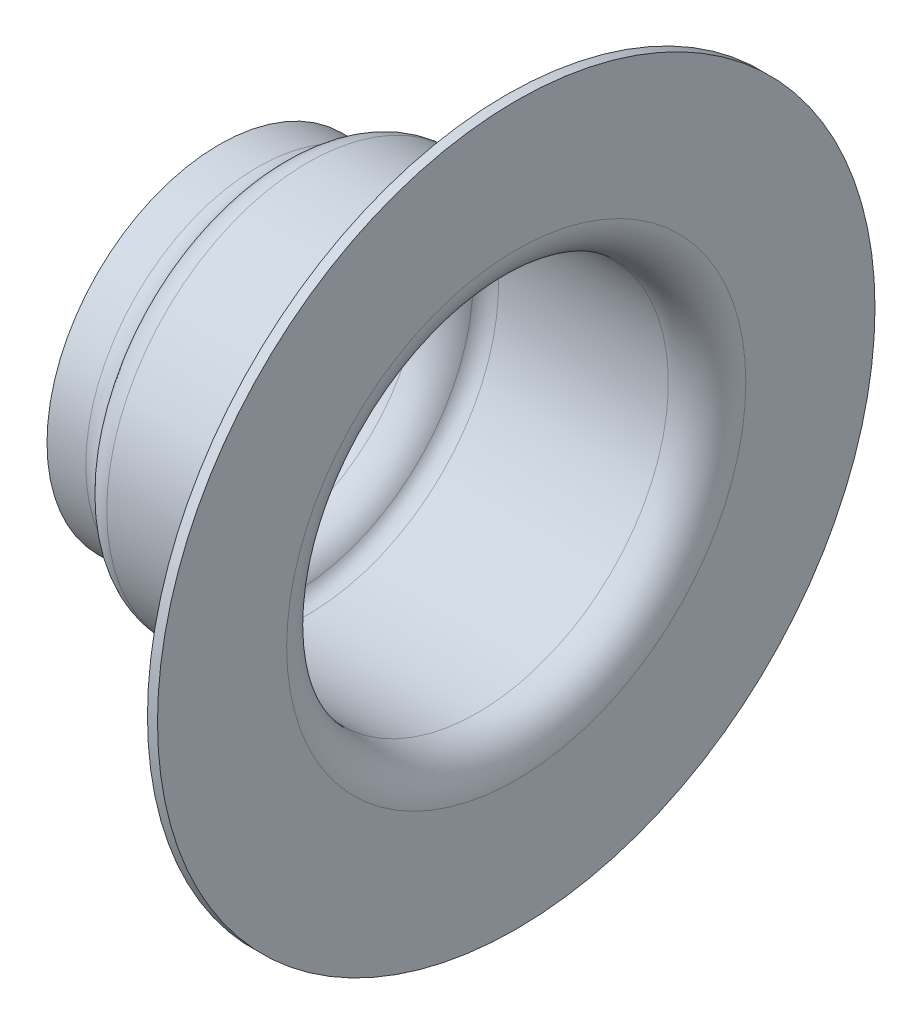
ISO-10303-21;
HEADER;
FILE_DESCRIPTION(('STEP AP214'),'2;1');
FILE_NAME('part.step','',(''),(''),'','','');
FILE_SCHEMA(('AUTOMOTIVE_DESIGN { 1 0 10303 214 1 1 1 1 }'));
ENDSEC;
DATA;
#1=APPLICATION_CONTEXT('core data for automotive mechanical design processes');
#2=APPLICATION_PROTOCOL_DEFINITION('international standard','automotive_design',2000,#1);
#3=PRODUCT_CONTEXT('',#1,'mechanical');
#4=PRODUCT('Part','Part','',(#3));
#5=PRODUCT_RELATED_PRODUCT_CATEGORY('part','',(#4));
#6=PRODUCT_DEFINITION_FORMATION('','',#4);
#7=PRODUCT_DEFINITION_CONTEXT('part definition',#1,'design');
#8=PRODUCT_DEFINITION('design','',#6,#7);
#9=PRODUCT_DEFINITION_SHAPE('','',#8);
#10=(LENGTH_UNIT() NAMED_UNIT(*) SI_UNIT(.MILLI.,.METRE.));
#11=(NAMED_UNIT(*) PLANE_ANGLE_UNIT() SI_UNIT($,.RADIAN.));
#12=(NAMED_UNIT(*) SI_UNIT($,.STERADIAN.) SOLID_ANGLE_UNIT());
#13=UNCERTAINTY_MEASURE_WITH_UNIT(LENGTH_MEASURE(1.E-05),#10,'distance_accuracy_value','');
#14=(GEOMETRIC_REPRESENTATION_CONTEXT(3) GLOBAL_UNCERTAINTY_ASSIGNED_CONTEXT((#13)) GLOBAL_UNIT_ASSIGNED_CONTEXT((#10,
#11,#12)) REPRESENTATION_CONTEXT('',''));
#15=CARTESIAN_POINT('',(0.,0.,0.));
#16=DIRECTION('',(0.,0.,1.));
#17=DIRECTION('',(1.,0.,0.));
#18=AXIS2_PLACEMENT_3D('',#15,#16,#17);
#19=CARTESIAN_POINT('',(284.436841982676,234.763666776708,16.9539636456932));
#20=DIRECTION('',(1.,0.,0.));
#21=DIRECTION('',(0.,0.,1.));
#22=AXIS2_PLACEMENT_3D('',#19,#20,#21);
#23=CYLINDRICAL_SURFACE('',#22,25.);
#24=CARTESIAN_POINT('',(285.136841982676,234.763666776708,16.9539636456932));
#25=DIRECTION('',(1.,0.,0.));
#26=DIRECTION('',(0.,0.,-1.));
#27=AXIS2_PLACEMENT_3D('',#24,#25,#26);
#28=CIRCLE('',#27,25.);
#29=CARTESIAN_POINT('',(285.136841982676,234.763666776708,-8.0460363543068));
#30=VERTEX_POINT('',#29);
#31=EDGE_CURVE('E34',#30,#30,#28,.T.);
#32=ORIENTED_EDGE('',*,*,#31,.F.);
#33=EDGE_LOOP('',(#32));
#34=FACE_BOUND('',#33,.T.);
#35=CARTESIAN_POINT('',(284.436841982676,234.763666776708,16.9539636456932));
#36=DIRECTION('',(1.,0.,0.));
#37=DIRECTION('',(0.,0.,-1.));
#38=AXIS2_PLACEMENT_3D('',#35,#36,#37);
#39=CIRCLE('',#38,25.);
#40=CARTESIAN_POINT('',(284.436841982676,234.763666776708,-8.0460363543068));
#41=VERTEX_POINT('',#40);
#42=EDGE_CURVE('E11',#41,#41,#39,.T.);
#43=ORIENTED_EDGE('',*,*,#42,.T.);
#44=EDGE_LOOP('',(#43));
#45=FACE_BOUND('',#44,.T.);
#46=ADVANCED_FACE('F17',(#34,#45),#23,.T.);
#47=CARTESIAN_POINT('',(264.436841982676,234.763666776708,16.9539636456932));
#48=DIRECTION('',(-1.,0.,0.));
#49=DIRECTION('',(0.,0.,-1.));
#50=AXIS2_PLACEMENT_3D('',#47,#48,#49);
#51=PLANE('',#50);
#52=CARTESIAN_POINT('',(264.436841982676,234.763666776708,16.9539636456932));
#53=DIRECTION('',(1.,0.,0.));
#54=DIRECTION('',(0.,0.,1.));
#55=AXIS2_PLACEMENT_3D('',#52,#53,#54);
#56=CIRCLE('',#55,11.3);
#57=CARTESIAN_POINT('',(264.436841982676,234.763666776708,28.2539636456932));
#58=VERTEX_POINT('',#57);
#59=EDGE_CURVE('E27',#58,#58,#56,.T.);
#60=ORIENTED_EDGE('',*,*,#59,.T.);
#61=EDGE_LOOP('',(#60));
#62=FACE_BOUND('',#61,.T.);
#63=CARTESIAN_POINT('',(264.436841982676,234.763666776708,16.9539636456932));
#64=DIRECTION('',(1.,0.,0.));
#65=DIRECTION('',(0.,0.,-1.));
#66=AXIS2_PLACEMENT_3D('',#63,#64,#65);
#67=CIRCLE('',#66,12.);
#68=CARTESIAN_POINT('',(264.436841982676,234.763666776708,4.9539636456932));
#69=VERTEX_POINT('',#68);
#70=EDGE_CURVE('E77',#69,#69,#67,.T.);
#71=ORIENTED_EDGE('',*,*,#70,.F.);
#72=EDGE_LOOP('',(#71));
#73=FACE_BOUND('',#72,.T.);
#74=ADVANCED_FACE('F129',(#62,#73),#51,.T.);
#75=CARTESIAN_POINT('',(285.136841982676,234.763666776708,16.9539636456932));
#76=DIRECTION('',(-1.,0.,0.));
#77=DIRECTION('',(0.,0.,-1.));
#78=AXIS2_PLACEMENT_3D('',#75,#76,#77);
#79=CYLINDRICAL_SURFACE('',#78,13.3);
#80=CARTESIAN_POINT('',(270.600943597814,234.763666776708,16.9539636456932));
#81=DIRECTION('',(1.,0.,0.));
#82=DIRECTION('',(0.,0.,1.));
#83=AXIS2_PLACEMENT_3D('',#80,#81,#82);
#84=CIRCLE('',#83,13.3);
#85=CARTESIAN_POINT('',(270.600943597814,234.763666776708,30.2539636456932));
#86=VERTEX_POINT('',#85);
#87=EDGE_CURVE('E87',#86,#86,#84,.T.);
#88=ORIENTED_EDGE('',*,*,#87,.F.);
#89=EDGE_LOOP('',(#88));
#90=FACE_BOUND('',#89,.T.);
#91=CARTESIAN_POINT('',(282.436841982676,234.763666776708,16.9539636456932));
#92=DIRECTION('',(-1.,0.,0.));
#93=DIRECTION('',(0.,0.,1.));
#94=AXIS2_PLACEMENT_3D('',#91,#92,#93);
#95=CIRCLE('',#94,13.3);
#96=CARTESIAN_POINT('',(282.436841982676,234.763666776708,30.2539636456932));
#97=VERTEX_POINT('',#96);
#98=EDGE_CURVE('E91',#97,#97,#95,.T.);
#99=ORIENTED_EDGE('',*,*,#98,.F.);
#100=EDGE_LOOP('',(#99));
#101=FACE_BOUND('',#100,.T.);
#102=ADVANCED_FACE('F134',(#90,#101),#79,.F.);
#103=CARTESIAN_POINT('',(270.600943597814,234.763666776708,16.9539636456932));
#104=DIRECTION('',(-1.,0.,0.));
#105=DIRECTION('',(0.,0.,-1.));
#106=AXIS2_PLACEMENT_3D('',#103,#104,#105);
#107=TOROIDAL_SURFACE('',#106,12.,1.3);
#108=CARTESIAN_POINT('',(269.475110572894,234.763666776708,16.9539636456932));
#109=DIRECTION('',(-1.,0.,0.));
#110=DIRECTION('',(0.,0.,1.));
#111=AXIS2_PLACEMENT_3D('',#108,#109,#110);
#112=CIRCLE('',#111,12.65);
#113=CARTESIAN_POINT('',(269.475110572894,234.763666776708,29.6039636456932));
#114=VERTEX_POINT('',#113);
#115=EDGE_CURVE('E90',#114,#114,#112,.T.);
#116=ORIENTED_EDGE('',*,*,#115,.T.);
#117=EDGE_LOOP('',(#116));
#118=FACE_BOUND('',#117,.T.);
#119=ORIENTED_EDGE('',*,*,#87,.T.);
#120=EDGE_LOOP('',(#119));
#121=FACE_BOUND('',#120,.T.);
#122=ADVANCED_FACE('F141',(#118,#121),#107,.F.);
#123=CARTESIAN_POINT('',(282.436841982676,234.763666776708,16.9539636456932));
#124=DIRECTION('',(-1.,0.,0.));
#125=DIRECTION('',(0.,0.,-1.));
#126=AXIS2_PLACEMENT_3D('',#123,#124,#125);
#127=TOROIDAL_SURFACE('',#126,16.,2.7);
#128=ORIENTED_EDGE('',*,*,#98,.T.);
#129=EDGE_LOOP('',(#128));
#130=FACE_BOUND('',#129,.T.);
#131=CARTESIAN_POINT('',(285.136841982676,234.763666776708,16.9539636456932));
#132=DIRECTION('',(1.,0.,0.));
#133=DIRECTION('',(0.,0.,1.));
#134=AXIS2_PLACEMENT_3D('',#131,#132,#133);
#135=CIRCLE('',#134,16.);
#136=CARTESIAN_POINT('',(285.136841982676,234.763666776708,32.9539636456932));
#137=VERTEX_POINT('',#136);
#138=EDGE_CURVE('E94',#137,#137,#135,.T.);
#139=ORIENTED_EDGE('',*,*,#138,.T.);
#140=EDGE_LOOP('',(#139));
#141=FACE_BOUND('',#140,.T.);
#142=ADVANCED_FACE('F145',(#130,#141),#127,.T.);
#143=CARTESIAN_POINT('',(285.136841982676,234.763666776708,16.9539636456932));
#144=DIRECTION('',(-1.,0.,0.));
#145=DIRECTION('',(0.,0.,-1.));
#146=AXIS2_PLACEMENT_3D('',#143,#144,#145);
#147=CYLINDRICAL_SURFACE('',#146,11.3);
#148=CARTESIAN_POINT('',(267.136841982676,234.763666776708,16.9539636456932));
#149=DIRECTION('',(-1.,0.,0.));
#150=DIRECTION('',(0.,0.,1.));
#151=AXIS2_PLACEMENT_3D('',#148,#149,#150);
#152=CIRCLE('',#151,11.3);
#153=CARTESIAN_POINT('',(267.136841982676,234.763666776708,28.2539636456932));
#154=VERTEX_POINT('',#153);
#155=EDGE_CURVE('E99',#154,#154,#152,.T.);
#156=ORIENTED_EDGE('',*,*,#155,.F.);
#157=EDGE_LOOP('',(#156));
#158=FACE_BOUND('',#157,.T.);
#159=ORIENTED_EDGE('',*,*,#59,.F.);
#160=EDGE_LOOP('',(#159));
#161=FACE_BOUND('',#160,.T.);
#162=ADVANCED_FACE('F149',(#158,#161),#147,.F.);
#163=CARTESIAN_POINT('',(285.136841982676,234.763666776708,16.9539636456932));
#164=DIRECTION('',(-1.,0.,0.));
#165=DIRECTION('',(0.,0.,-1.));
#166=AXIS2_PLACEMENT_3D('',#163,#164,#165);
#167=PLANE('',#166);
#168=ORIENTED_EDGE('',*,*,#138,.F.);
#169=EDGE_LOOP('',(#168));
#170=FACE_BOUND('',#169,.T.);
#171=ORIENTED_EDGE('',*,*,#31,.T.);
#172=EDGE_LOOP('',(#171));
#173=FACE_BOUND('',#172,.T.);
#174=ADVANCED_FACE('F153',(#170,#173),#167,.F.);
#175=CARTESIAN_POINT('',(267.136841982676,234.763666776708,16.9539636456932));
#176=DIRECTION('',(-1.,0.,0.));
#177=DIRECTION('',(0.,0.,-1.));
#178=AXIS2_PLACEMENT_3D('',#175,#176,#177);
#179=TOROIDAL_SURFACE('',#178,14.,2.7);
#180=ORIENTED_EDGE('',*,*,#115,.F.);
#181=EDGE_LOOP('',(#180));
#182=FACE_BOUND('',#181,.T.);
#183=ORIENTED_EDGE('',*,*,#155,.T.);
#184=EDGE_LOOP('',(#183));
#185=FACE_BOUND('',#184,.T.);
#186=ADVANCED_FACE('F116',(#182,#185),#179,.T.);
#187=CARTESIAN_POINT('',(285.136841982676,234.763666776708,16.9539636456932));
#188=DIRECTION('',(-1.,0.,0.));
#189=DIRECTION('',(0.,0.,-1.));
#190=AXIS2_PLACEMENT_3D('',#187,#188,#189);
#191=CYLINDRICAL_SURFACE('',#190,14.);
#192=CARTESIAN_POINT('',(270.600943597814,234.763666776708,16.9539636456932));
#193=DIRECTION('',(1.,0.,0.));
#194=DIRECTION('',(0.,0.,1.));
#195=AXIS2_PLACEMENT_3D('',#192,#193,#194);
#196=CIRCLE('',#195,14.);
#197=CARTESIAN_POINT('',(270.600943597814,234.763666776708,30.9539636456932));
#198=VERTEX_POINT('',#197);
#199=EDGE_CURVE('E79',#198,#198,#196,.T.);
#200=ORIENTED_EDGE('',*,*,#199,.T.);
#201=EDGE_LOOP('',(#200));
#202=FACE_BOUND('',#201,.T.);
#203=CARTESIAN_POINT('',(282.436841982676,234.763666776708,16.9539636456932));
#204=DIRECTION('',(-1.,0.,0.));
#205=DIRECTION('',(0.,0.,1.));
#206=AXIS2_PLACEMENT_3D('',#203,#204,#205);
#207=CIRCLE('',#206,14.);
#208=CARTESIAN_POINT('',(282.436841982676,234.763666776708,30.9539636456932));
#209=VERTEX_POINT('',#208);
#210=EDGE_CURVE('E76',#209,#209,#207,.T.);
#211=ORIENTED_EDGE('',*,*,#210,.T.);
#212=EDGE_LOOP('',(#211));
#213=FACE_BOUND('',#212,.T.);
#214=ADVANCED_FACE('F111',(#202,#213),#191,.T.);
#215=CARTESIAN_POINT('',(270.600943597814,234.763666776708,16.9539636456932));
#216=DIRECTION('',(-1.,0.,0.));
#217=DIRECTION('',(0.,0.,-1.));
#218=AXIS2_PLACEMENT_3D('',#215,#216,#217);
#219=TOROIDAL_SURFACE('',#218,12.,2.);
#220=CARTESIAN_POINT('',(268.868892790245,234.763666776708,16.9539636456932));
#221=DIRECTION('',(-1.,0.,0.));
#222=DIRECTION('',(0.,0.,1.));
#223=AXIS2_PLACEMENT_3D('',#220,#221,#222);
#224=CIRCLE('',#223,13.);
#225=CARTESIAN_POINT('',(268.868892790245,234.763666776708,29.9539636456932));
#226=VERTEX_POINT('',#225);
#227=EDGE_CURVE('E84',#226,#226,#224,.T.);
#228=ORIENTED_EDGE('',*,*,#227,.F.);
#229=EDGE_LOOP('',(#228));
#230=FACE_BOUND('',#229,.T.);
#231=ORIENTED_EDGE('',*,*,#199,.F.);
#232=EDGE_LOOP('',(#231));
#233=FACE_BOUND('',#232,.T.);
#234=ADVANCED_FACE('F107',(#230,#233),#219,.T.);
#235=CARTESIAN_POINT('',(282.436841982676,234.763666776708,16.9539636456932));
#236=DIRECTION('',(-1.,0.,0.));
#237=DIRECTION('',(0.,0.,-1.));
#238=AXIS2_PLACEMENT_3D('',#235,#236,#237);
#239=TOROIDAL_SURFACE('',#238,16.,2.);
#240=ORIENTED_EDGE('',*,*,#210,.F.);
#241=EDGE_LOOP('',(#240));
#242=FACE_BOUND('',#241,.T.);
#243=CARTESIAN_POINT('',(284.436841982676,234.763666776708,16.9539636456932));
#244=DIRECTION('',(1.,0.,0.));
#245=DIRECTION('',(0.,0.,1.));
#246=AXIS2_PLACEMENT_3D('',#243,#244,#245);
#247=CIRCLE('',#246,16.);
#248=CARTESIAN_POINT('',(284.436841982676,234.763666776708,32.9539636456932));
#249=VERTEX_POINT('',#248);
#250=EDGE_CURVE('E71',#249,#249,#247,.T.);
#251=ORIENTED_EDGE('',*,*,#250,.F.);
#252=EDGE_LOOP('',(#251));
#253=FACE_BOUND('',#252,.T.);
#254=ADVANCED_FACE('F110',(#242,#253),#239,.F.);
#255=CARTESIAN_POINT('',(285.136841982676,234.763666776708,16.9539636456932));
#256=DIRECTION('',(-1.,0.,0.));
#257=DIRECTION('',(0.,0.,-1.));
#258=AXIS2_PLACEMENT_3D('',#255,#256,#257);
#259=CYLINDRICAL_SURFACE('',#258,12.);
#260=CARTESIAN_POINT('',(267.136841982676,234.763666776708,16.9539636456932));
#261=DIRECTION('',(-1.,0.,0.));
#262=DIRECTION('',(0.,0.,1.));
#263=AXIS2_PLACEMENT_3D('',#260,#261,#262);
#264=CIRCLE('',#263,12.);
#265=CARTESIAN_POINT('',(267.136841982676,234.763666776708,28.9539636456932));
#266=VERTEX_POINT('',#265);
#267=EDGE_CURVE('E21',#266,#266,#264,.T.);
#268=ORIENTED_EDGE('',*,*,#267,.T.);
#269=EDGE_LOOP('',(#268));
#270=FACE_BOUND('',#269,.T.);
#271=ORIENTED_EDGE('',*,*,#70,.T.);
#272=EDGE_LOOP('',(#271));
#273=FACE_BOUND('',#272,.T.);
#274=ADVANCED_FACE('F120',(#270,#273),#259,.T.);
#275=CARTESIAN_POINT('',(284.436841982676,234.763666776708,16.9539636456932));
#276=DIRECTION('',(-1.,0.,0.));
#277=DIRECTION('',(0.,0.,-1.));
#278=AXIS2_PLACEMENT_3D('',#275,#276,#277);
#279=PLANE('',#278);
#280=ORIENTED_EDGE('',*,*,#250,.T.);
#281=EDGE_LOOP('',(#280));
#282=FACE_BOUND('',#281,.T.);
#283=ORIENTED_EDGE('',*,*,#42,.F.);
#284=EDGE_LOOP('',(#283));
#285=FACE_BOUND('',#284,.T.);
#286=ADVANCED_FACE('F126',(#282,#285),#279,.T.);
#287=CARTESIAN_POINT('',(267.136841982676,234.763666776708,16.9539636456932));
#288=DIRECTION('',(-1.,0.,0.));
#289=DIRECTION('',(0.,0.,-1.));
#290=AXIS2_PLACEMENT_3D('',#287,#288,#289);
#291=TOROIDAL_SURFACE('',#290,14.,2.);
#292=ORIENTED_EDGE('',*,*,#227,.T.);
#293=EDGE_LOOP('',(#292));
#294=FACE_BOUND('',#293,.T.);
#295=ORIENTED_EDGE('',*,*,#267,.F.);
#296=EDGE_LOOP('',(#295));
#297=FACE_BOUND('',#296,.T.);
#298=ADVANCED_FACE('F19',(#294,#297),#291,.F.);
#299=CLOSED_SHELL('',(#46,#74,#102,#122,#142,#162,#174,#186,#214,#234,#254,#274,#286,#298));
#300=MANIFOLD_SOLID_BREP('B1',#299);
#301=ADVANCED_BREP_SHAPE_REPRESENTATION('',(#18,#300),#14);
#302=SHAPE_DEFINITION_REPRESENTATION(#9,#301);
ENDSEC;
END-ISO-10303-21;
